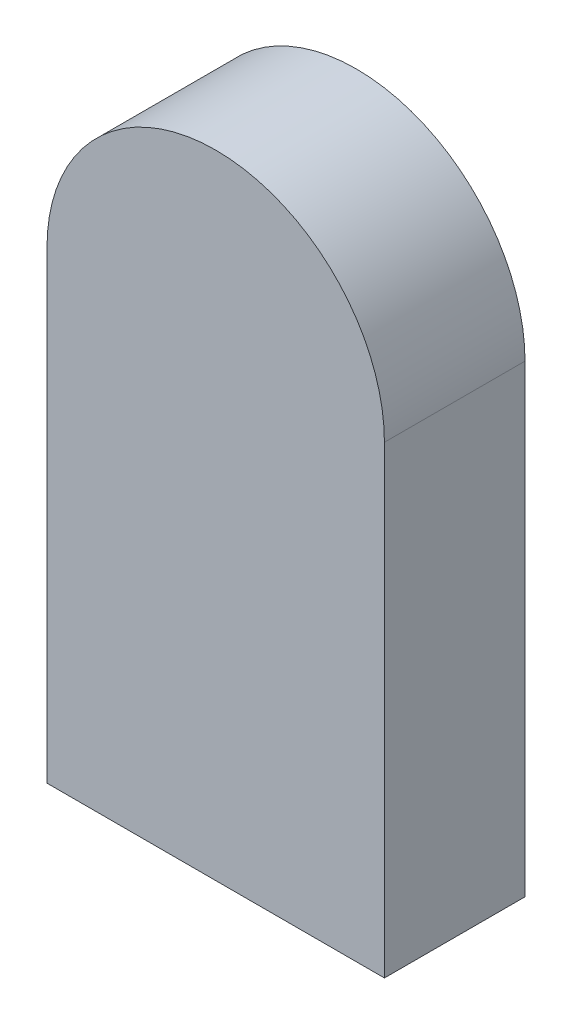
ISO-10303-21;
HEADER;
FILE_DESCRIPTION(('STEP AP214'),'2;1');
FILE_NAME('part.step','',(''),(''),'','','');
FILE_SCHEMA(('AUTOMOTIVE_DESIGN { 1 0 10303 214 1 1 1 1 }'));
ENDSEC;
DATA;
#1=APPLICATION_CONTEXT('core data for automotive mechanical design processes');
#2=APPLICATION_PROTOCOL_DEFINITION('international standard','automotive_design',2000,#1);
#3=PRODUCT_CONTEXT('',#1,'mechanical');
#4=PRODUCT('Part','Part','',(#3));
#5=PRODUCT_RELATED_PRODUCT_CATEGORY('part','',(#4));
#6=PRODUCT_DEFINITION_FORMATION('','',#4);
#7=PRODUCT_DEFINITION_CONTEXT('part definition',#1,'design');
#8=PRODUCT_DEFINITION('design','',#6,#7);
#9=PRODUCT_DEFINITION_SHAPE('','',#8);
#10=(LENGTH_UNIT() NAMED_UNIT(*) SI_UNIT(.MILLI.,.METRE.));
#11=(NAMED_UNIT(*) PLANE_ANGLE_UNIT() SI_UNIT($,.RADIAN.));
#12=(NAMED_UNIT(*) SI_UNIT($,.STERADIAN.) SOLID_ANGLE_UNIT());
#13=UNCERTAINTY_MEASURE_WITH_UNIT(LENGTH_MEASURE(1.E-05),#10,'distance_accuracy_value','');
#14=(GEOMETRIC_REPRESENTATION_CONTEXT(3) GLOBAL_UNCERTAINTY_ASSIGNED_CONTEXT((#13)) GLOBAL_UNIT_ASSIGNED_CONTEXT((#10,
#11,#12)) REPRESENTATION_CONTEXT('',''));
#15=CARTESIAN_POINT('',(0.,0.,0.));
#16=DIRECTION('',(0.,0.,1.));
#17=DIRECTION('',(1.,0.,0.));
#18=AXIS2_PLACEMENT_3D('',#15,#16,#17);
#19=CARTESIAN_POINT('',(-2.37,-4.05,0.));
#20=DIRECTION('',(0.,1.,0.));
#21=DIRECTION('',(1.,0.,0.));
#22=AXIS2_PLACEMENT_3D('',#19,#20,#21);
#23=PLANE('',#22);
#24=DIRECTION('',(1.,0.,0.));
#25=VECTOR('',#24,1.);
#26=CARTESIAN_POINT('',(-2.37,-4.05,0.));
#27=LINE('',#26,#25);
#28=CARTESIAN_POINT('',(-2.37,-4.05,0.));
#29=VERTEX_POINT('',#28);
#30=CARTESIAN_POINT('',(-2.13,-4.05,0.));
#31=VERTEX_POINT('',#30);
#32=EDGE_CURVE('E11',#29,#31,#27,.T.);
#33=ORIENTED_EDGE('',*,*,#32,.T.);
#34=DIRECTION('',(0.,0.,1.));
#35=VECTOR('',#34,1.);
#36=CARTESIAN_POINT('',(-2.13,-4.05,0.));
#37=LINE('',#36,#35);
#38=CARTESIAN_POINT('',(-2.13,-4.05,0.1));
#39=VERTEX_POINT('',#38);
#40=EDGE_CURVE('E24',#31,#39,#37,.T.);
#41=ORIENTED_EDGE('',*,*,#40,.T.);
#42=DIRECTION('',(1.,0.,0.));
#43=VECTOR('',#42,1.);
#44=CARTESIAN_POINT('',(-2.37,-4.05,0.1));
#45=LINE('',#44,#43);
#46=CARTESIAN_POINT('',(-2.37,-4.05,0.1));
#47=VERTEX_POINT('',#46);
#48=EDGE_CURVE('E87',#47,#39,#45,.T.);
#49=ORIENTED_EDGE('',*,*,#48,.F.);
#50=DIRECTION('',(0.,0.,1.));
#51=VECTOR('',#50,1.);
#52=CARTESIAN_POINT('',(-2.37,-4.05,0.));
#53=LINE('',#52,#51);
#54=EDGE_CURVE('E36',#29,#47,#53,.T.);
#55=ORIENTED_EDGE('',*,*,#54,.F.);
#56=EDGE_LOOP('',(#33,#41,#49,#55));
#57=FACE_BOUND('',#56,.T.);
#58=ADVANCED_FACE('F17',(#57),#23,.F.);
#59=CARTESIAN_POINT('',(-2.13,-4.05,0.));
#60=DIRECTION('',(-1.,0.,0.));
#61=DIRECTION('',(0.,1.,0.));
#62=AXIS2_PLACEMENT_3D('',#59,#60,#61);
#63=PLANE('',#62);
#64=DIRECTION('',(0.,1.,0.));
#65=VECTOR('',#64,1.);
#66=CARTESIAN_POINT('',(-2.13,-4.05,0.));
#67=LINE('',#66,#65);
#68=CARTESIAN_POINT('',(-2.13,-3.72,0.));
#69=VERTEX_POINT('',#68);
#70=EDGE_CURVE('E84',#31,#69,#67,.T.);
#71=ORIENTED_EDGE('',*,*,#70,.T.);
#72=DIRECTION('',(0.,0.,1.));
#73=VECTOR('',#72,1.);
#74=CARTESIAN_POINT('',(-2.13,-3.72,0.));
#75=LINE('',#74,#73);
#76=CARTESIAN_POINT('',(-2.13,-3.72,0.1));
#77=VERTEX_POINT('',#76);
#78=EDGE_CURVE('E82',#69,#77,#75,.T.);
#79=ORIENTED_EDGE('',*,*,#78,.T.);
#80=DIRECTION('',(0.,1.,0.));
#81=VECTOR('',#80,1.);
#82=CARTESIAN_POINT('',(-2.13,-4.05,0.1));
#83=LINE('',#82,#81);
#84=EDGE_CURVE('E72',#39,#77,#83,.T.);
#85=ORIENTED_EDGE('',*,*,#84,.F.);
#86=ORIENTED_EDGE('',*,*,#40,.F.);
#87=EDGE_LOOP('',(#71,#79,#85,#86));
#88=FACE_BOUND('',#87,.T.);
#89=ADVANCED_FACE('F89',(#88),#63,.F.);
#90=CARTESIAN_POINT('',(-2.25,-3.72,0.));
#91=DIRECTION('',(0.,0.,-1.));
#92=DIRECTION('',(1.,0.,0.));
#93=AXIS2_PLACEMENT_3D('',#90,#91,#92);
#94=CYLINDRICAL_SURFACE('',#93,0.12);
#95=CARTESIAN_POINT('',(-2.25,-3.72,0.));
#96=DIRECTION('',(0.,0.,1.));
#97=DIRECTION('',(1.,0.,0.));
#98=AXIS2_PLACEMENT_3D('',#95,#96,#97);
#99=CIRCLE('',#98,0.12);
#100=CARTESIAN_POINT('',(-2.37,-3.72,0.));
#101=VERTEX_POINT('',#100);
#102=EDGE_CURVE('E62',#69,#101,#99,.T.);
#103=ORIENTED_EDGE('',*,*,#102,.T.);
#104=DIRECTION('',(0.,0.,1.));
#105=VECTOR('',#104,1.);
#106=CARTESIAN_POINT('',(-2.37,-3.72,0.));
#107=LINE('',#106,#105);
#108=CARTESIAN_POINT('',(-2.37,-3.72,0.1));
#109=VERTEX_POINT('',#108);
#110=EDGE_CURVE('E57',#101,#109,#107,.T.);
#111=ORIENTED_EDGE('',*,*,#110,.T.);
#112=CARTESIAN_POINT('',(-2.25,-3.72,0.1));
#113=DIRECTION('',(0.,0.,1.));
#114=DIRECTION('',(1.,0.,0.));
#115=AXIS2_PLACEMENT_3D('',#112,#113,#114);
#116=CIRCLE('',#115,0.12);
#117=EDGE_CURVE('E60',#77,#109,#116,.T.);
#118=ORIENTED_EDGE('',*,*,#117,.F.);
#119=ORIENTED_EDGE('',*,*,#78,.F.);
#120=EDGE_LOOP('',(#103,#111,#118,#119));
#121=FACE_BOUND('',#120,.T.);
#122=ADVANCED_FACE('F59',(#121),#94,.T.);
#123=CARTESIAN_POINT('',(-2.37,-4.05,0.));
#124=DIRECTION('',(-1.,0.,0.));
#125=DIRECTION('',(0.,1.,0.));
#126=AXIS2_PLACEMENT_3D('',#123,#124,#125);
#127=PLANE('',#126);
#128=ORIENTED_EDGE('',*,*,#54,.T.);
#129=DIRECTION('',(0.,1.,0.));
#130=VECTOR('',#129,1.);
#131=CARTESIAN_POINT('',(-2.37,-4.05,0.1));
#132=LINE('',#131,#130);
#133=EDGE_CURVE('E71',#47,#109,#132,.T.);
#134=ORIENTED_EDGE('',*,*,#133,.T.);
#135=ORIENTED_EDGE('',*,*,#110,.F.);
#136=DIRECTION('',(0.,1.,0.));
#137=VECTOR('',#136,1.);
#138=CARTESIAN_POINT('',(-2.37,-4.05,0.));
#139=LINE('',#138,#137);
#140=EDGE_CURVE('E76',#29,#101,#139,.T.);
#141=ORIENTED_EDGE('',*,*,#140,.F.);
#142=EDGE_LOOP('',(#128,#134,#135,#141));
#143=FACE_BOUND('',#142,.T.);
#144=ADVANCED_FACE('F75',(#143),#127,.T.);
#145=CARTESIAN_POINT('',(-2.25,-3.849490847913,0.));
#146=DIRECTION('',(0.,0.,1.));
#147=DIRECTION('',(1.,0.,0.));
#148=AXIS2_PLACEMENT_3D('',#145,#146,#147);
#149=PLANE('',#148);
#150=ORIENTED_EDGE('',*,*,#140,.T.);
#151=ORIENTED_EDGE('',*,*,#102,.F.);
#152=ORIENTED_EDGE('',*,*,#70,.F.);
#153=ORIENTED_EDGE('',*,*,#32,.F.);
#154=EDGE_LOOP('',(#150,#151,#152,#153));
#155=FACE_BOUND('',#154,.T.);
#156=ADVANCED_FACE('F91',(#155),#149,.F.);
#157=CARTESIAN_POINT('',(-2.25,-3.849490847913,0.1));
#158=DIRECTION('',(0.,0.,1.));
#159=DIRECTION('',(1.,0.,0.));
#160=AXIS2_PLACEMENT_3D('',#157,#158,#159);
#161=PLANE('',#160);
#162=ORIENTED_EDGE('',*,*,#48,.T.);
#163=ORIENTED_EDGE('',*,*,#84,.T.);
#164=ORIENTED_EDGE('',*,*,#117,.T.);
#165=ORIENTED_EDGE('',*,*,#133,.F.);
#166=EDGE_LOOP('',(#162,#163,#164,#165));
#167=FACE_BOUND('',#166,.T.);
#168=ADVANCED_FACE('F70',(#167),#161,.T.);
#169=CLOSED_SHELL('',(#58,#89,#122,#144,#156,#168));
#170=MANIFOLD_SOLID_BREP('B1',#169);
#171=ADVANCED_BREP_SHAPE_REPRESENTATION('',(#18,#170),#14);
#172=SHAPE_DEFINITION_REPRESENTATION(#9,#171);
ENDSEC;
END-ISO-10303-21;
